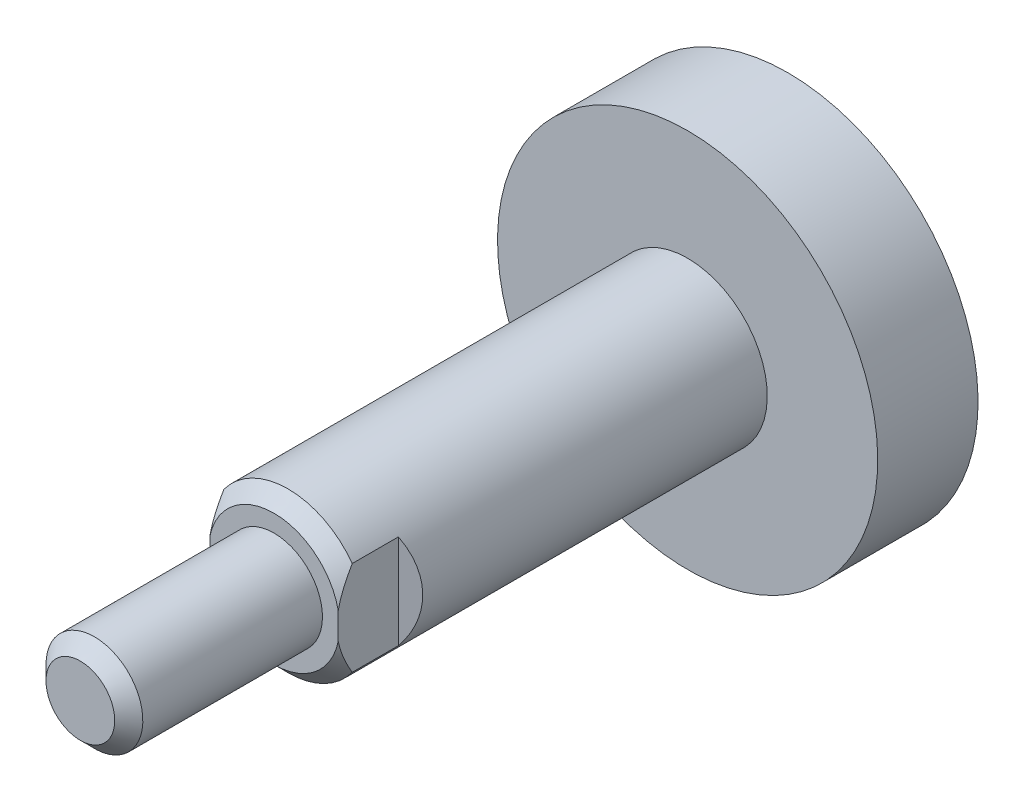
ISO-10303-21;
HEADER;
FILE_DESCRIPTION(('STEP AP214'),'2;1');
FILE_NAME('part.step','',(''),(''),'','','');
FILE_SCHEMA(('AUTOMOTIVE_DESIGN { 1 0 10303 214 1 1 1 1 }'));
ENDSEC;
DATA;
#1=APPLICATION_CONTEXT('core data for automotive mechanical design processes');
#2=APPLICATION_PROTOCOL_DEFINITION('international standard','automotive_design',2000,#1);
#3=PRODUCT_CONTEXT('',#1,'mechanical');
#4=PRODUCT('Part','Part','',(#3));
#5=PRODUCT_RELATED_PRODUCT_CATEGORY('part','',(#4));
#6=PRODUCT_DEFINITION_FORMATION('','',#4);
#7=PRODUCT_DEFINITION_CONTEXT('part definition',#1,'design');
#8=PRODUCT_DEFINITION('design','',#6,#7);
#9=PRODUCT_DEFINITION_SHAPE('','',#8);
#10=(LENGTH_UNIT() NAMED_UNIT(*) SI_UNIT(.MILLI.,.METRE.));
#11=(NAMED_UNIT(*) PLANE_ANGLE_UNIT() SI_UNIT($,.RADIAN.));
#12=(NAMED_UNIT(*) SI_UNIT($,.STERADIAN.) SOLID_ANGLE_UNIT());
#13=UNCERTAINTY_MEASURE_WITH_UNIT(LENGTH_MEASURE(1.E-05),#10,'distance_accuracy_value','');
#14=(GEOMETRIC_REPRESENTATION_CONTEXT(3) GLOBAL_UNCERTAINTY_ASSIGNED_CONTEXT((#13)) GLOBAL_UNIT_ASSIGNED_CONTEXT((#10,
#11,#12)) REPRESENTATION_CONTEXT('',''));
#15=CARTESIAN_POINT('',(0.,0.,0.));
#16=DIRECTION('',(0.,0.,1.));
#17=DIRECTION('',(1.,0.,0.));
#18=AXIS2_PLACEMENT_3D('',#15,#16,#17);
#19=CARTESIAN_POINT('',(0.,0.,35.266));
#20=DIRECTION('',(0.,0.,1.));
#21=DIRECTION('',(0.,-1.,0.));
#22=AXIS2_PLACEMENT_3D('',#19,#20,#21);
#23=PLANE('',#22);
#24=CARTESIAN_POINT('',(0.,0.,35.2659999999219));
#25=DIRECTION('',(0.,0.,-1.));
#26=DIRECTION('',(-1.,0.,0.));
#27=AXIS2_PLACEMENT_3D('',#24,#25,#26);
#28=CIRCLE('',#27,1.71299999999519);
#29=CARTESIAN_POINT('',(-1.71299999999519,0.,35.2659999999219));
#30=VERTEX_POINT('',#29);
#31=EDGE_CURVE('E19',#30,#30,#28,.T.);
#32=ORIENTED_EDGE('',*,*,#31,.F.);
#33=EDGE_LOOP('',(#32));
#34=FACE_BOUND('',#33,.T.);
#35=ADVANCED_FACE('F16',(#34),#23,.T.);
#36=CARTESIAN_POINT('',(0.,0.,34.5659999999839));
#37=DIRECTION('',(0.,0.,-1.));
#38=DIRECTION('',(-1.,0.,0.));
#39=AXIS2_PLACEMENT_3D('',#36,#37,#38);
#40=CONICAL_SURFACE('',#39,2.41299999993316,0.785398163397448);
#41=ORIENTED_EDGE('',*,*,#31,.T.);
#42=EDGE_LOOP('',(#41));
#43=FACE_BOUND('',#42,.T.);
#44=CARTESIAN_POINT('',(0.,0.,34.566));
#45=DIRECTION('',(0.,0.,-1.));
#46=DIRECTION('',(0.,1.,0.));
#47=AXIS2_PLACEMENT_3D('',#44,#45,#46);
#48=CIRCLE('',#47,2.413);
#49=CARTESIAN_POINT('',(0.,2.413,34.566));
#50=VERTEX_POINT('',#49);
#51=EDGE_CURVE('E71',#50,#50,#48,.T.);
#52=ORIENTED_EDGE('',*,*,#51,.F.);
#53=EDGE_LOOP('',(#52));
#54=FACE_BOUND('',#53,.T.);
#55=ADVANCED_FACE('F196',(#43,#54),#40,.T.);
#56=CARTESIAN_POINT('',(0.,0.,35.266));
#57=DIRECTION('',(0.,0.,-1.));
#58=DIRECTION('',(0.,1.,0.));
#59=AXIS2_PLACEMENT_3D('',#56,#57,#58);
#60=CYLINDRICAL_SURFACE('',#59,2.413);
#61=ORIENTED_EDGE('',*,*,#51,.T.);
#62=EDGE_LOOP('',(#61));
#63=FACE_BOUND('',#62,.T.);
#64=CARTESIAN_POINT('',(0.,0.,25.614));
#65=DIRECTION('',(0.,0.,-1.));
#66=DIRECTION('',(0.,1.,0.));
#67=AXIS2_PLACEMENT_3D('',#64,#65,#66);
#68=CIRCLE('',#67,2.413);
#69=CARTESIAN_POINT('',(0.,2.413,25.614));
#70=VERTEX_POINT('',#69);
#71=EDGE_CURVE('E70',#70,#70,#68,.F.);
#72=ORIENTED_EDGE('',*,*,#71,.T.);
#73=EDGE_LOOP('',(#72));
#74=FACE_BOUND('',#73,.T.);
#75=ADVANCED_FACE('F204',(#63,#74),#60,.T.);
#76=CARTESIAN_POINT('',(0.,0.,25.614));
#77=DIRECTION('',(0.,0.,-1.));
#78=DIRECTION('',(0.,1.,0.));
#79=AXIS2_PLACEMENT_3D('',#76,#77,#78);
#80=PLANE('',#79);
#81=ORIENTED_EDGE('',*,*,#71,.F.);
#82=EDGE_LOOP('',(#81));
#83=FACE_BOUND('',#82,.T.);
#84=DIRECTION('',(0.,1.,0.));
#85=VECTOR('',#84,1.);
#86=CARTESIAN_POINT('',(3.2,0.,25.614));
#87=LINE('',#86,#85);
#88=CARTESIAN_POINT('',(3.2,0.66810253703174,25.6140000000093));
#89=VERTEX_POINT('',#88);
#90=CARTESIAN_POINT('',(3.2,-0.668102537031729,25.6140000000093));
#91=VERTEX_POINT('',#90);
#92=EDGE_CURVE('E58',#89,#91,#87,.F.);
#93=ORIENTED_EDGE('',*,*,#92,.F.);
#94=CARTESIAN_POINT('',(0.,0.,25.6140000000187));
#95=DIRECTION('',(0.,0.,-1.));
#96=DIRECTION('',(0.,1.,0.));
#97=AXIS2_PLACEMENT_3D('',#94,#95,#96);
#98=CIRCLE('',#97,3.26899999998887);
#99=CARTESIAN_POINT('',(-3.2,0.668102537031733,25.6140000000093));
#100=VERTEX_POINT('',#99);
#101=EDGE_CURVE('E91',#100,#89,#98,.T.);
#102=ORIENTED_EDGE('',*,*,#101,.F.);
#103=DIRECTION('',(0.,1.,0.));
#104=VECTOR('',#103,1.);
#105=CARTESIAN_POINT('',(-3.2,-9.475,25.614));
#106=LINE('',#105,#104);
#107=CARTESIAN_POINT('',(-3.2,-0.668102537013458,25.6140000000131));
#108=VERTEX_POINT('',#107);
#109=EDGE_CURVE('E77',#100,#108,#106,.F.);
#110=ORIENTED_EDGE('',*,*,#109,.T.);
#111=CARTESIAN_POINT('',(0.,0.,25.6140000000187));
#112=DIRECTION('',(0.,0.,-1.));
#113=DIRECTION('',(0.,1.,0.));
#114=AXIS2_PLACEMENT_3D('',#111,#112,#113);
#115=CIRCLE('',#114,3.26899999998887);
#116=EDGE_CURVE('E75',#91,#108,#115,.T.);
#117=ORIENTED_EDGE('',*,*,#116,.F.);
#118=EDGE_LOOP('',(#93,#102,#110,#117));
#119=FACE_BOUND('',#118,.T.);
#120=ADVANCED_FACE('F76',(#83,#119),#80,.F.);
#121=CARTESIAN_POINT('',(0.,0.,24.9140000000807));
#122=DIRECTION('',(0.,0.,-1.));
#123=DIRECTION('',(0.,1.,0.));
#124=AXIS2_PLACEMENT_3D('',#121,#122,#123);
#125=CONICAL_SURFACE('',#124,3.96899999992684,0.785398163397448);
#126=CARTESIAN_POINT('',(-3.2,-0.668102537040877,25.6140000000075));
#127=CARTESIAN_POINT('',(-3.2,-0.791923989295427,25.5887118948215));
#128=CARTESIAN_POINT('',(-3.2,-0.91421443217869,25.5569533814341));
#129=CARTESIAN_POINT('',(-3.2,-1.15522323064115,25.4827867348097));
#130=CARTESIAN_POINT('',(-3.2,-1.27394966581364,25.4404051094269));
#131=CARTESIAN_POINT('',(-3.2,-1.50692397326224,25.3475394481761));
#132=CARTESIAN_POINT('',(-3.2,-1.62120166832552,25.2971285477306));
#133=CARTESIAN_POINT('',(-3.2,-1.84665634636372,25.1897204575844));
#134=CARTESIAN_POINT('',(-3.2,-1.95783200279579,25.1327205021723));
#135=CARTESIAN_POINT('',(-3.2,-2.11477722577384,25.0475447828539));
#136=CARTESIAN_POINT('',(-3.2,-2.1617013623651,25.0214620111321));
#137=CARTESIAN_POINT('',(-3.2,-2.25515024750113,24.9683835316657));
#138=CARTESIAN_POINT('',(-3.2,-2.30167405354123,24.9413861634533));
#139=CARTESIAN_POINT('',(-3.2,-2.34796954835779,24.9140000000056));
#140=B_SPLINE_CURVE_WITH_KNOTS('',3,(#126,#127,#128,#129,#130,#131,#132,#133,#134,#135,#136,
#137,#138,#139),.UNSPECIFIED.,.F.,.F.,(4,2,2,2,2,2,4),(0.,0.378663318902455,0.756391005201612,
1.13085654272106,1.50547983428745,1.66653163358814,1.82789340191387),.UNSPECIFIED.);
#141=CARTESIAN_POINT('',(-3.2,-2.34796954835613,24.9140000000028));
#142=VERTEX_POINT('',#141);
#143=EDGE_CURVE('E116',#108,#142,#140,.T.);
#144=ORIENTED_EDGE('',*,*,#143,.T.);
#145=CARTESIAN_POINT('',(0.,0.,24.914));
#146=DIRECTION('',(0.,0.,-1.));
#147=DIRECTION('',(0.,1.,0.));
#148=AXIS2_PLACEMENT_3D('',#145,#146,#147);
#149=CIRCLE('',#148,3.969);
#150=CARTESIAN_POINT('',(3.2,-2.34796954835614,24.9140000000028));
#151=VERTEX_POINT('',#150);
#152=EDGE_CURVE('E85',#151,#142,#149,.T.);
#153=ORIENTED_EDGE('',*,*,#152,.F.);
#154=CARTESIAN_POINT('',(3.2,-2.34796954835779,24.9140000000056));
#155=CARTESIAN_POINT('',(3.2,-2.28227540636543,24.9528576848515));
#156=CARTESIAN_POINT('',(3.2,-2.21612013327483,24.9909397042059));
#157=CARTESIAN_POINT('',(3.2,-2.08277615456897,25.0652931600532));
#158=CARTESIAN_POINT('',(3.2,-2.01558715528861,25.1015640691339));
#159=CARTESIAN_POINT('',(3.2,-1.81330543749888,25.2067462963329));
#160=CARTESIAN_POINT('',(3.2,-1.67658349378556,25.2725768397095));
#161=CARTESIAN_POINT('',(3.2,-1.39788707533627,25.3932563066724));
#162=CARTESIAN_POINT('',(3.2,-1.25590184063825,25.4480810761766));
#163=CARTESIAN_POINT('',(3.2,-0.966123687789918,25.543157171903));
#164=CARTESIAN_POINT('',(3.2,-0.818297789803371,25.5833066541195));
#165=CARTESIAN_POINT('',(3.2,-0.668102537040844,25.6140000000075));
#166=B_SPLINE_CURVE_WITH_KNOTS('',3,(#154,#155,#156,#157,#158,#159,#160,#161,#162,#163,#164,
#165),.UNSPECIFIED.,.F.,.F.,(4,2,2,2,2,4),(0.,0.228972156487763,0.458010607517,
0.912891486437008,1.36876002116515,1.82773469580356),.UNSPECIFIED.);
#167=EDGE_CURVE('E63',#151,#91,#166,.T.);
#168=ORIENTED_EDGE('',*,*,#167,.T.);
#169=ORIENTED_EDGE('',*,*,#116,.T.);
#170=EDGE_LOOP('',(#144,#153,#168,#169));
#171=FACE_BOUND('',#170,.T.);
#172=ADVANCED_FACE('F84',(#171),#125,.T.);
#173=CARTESIAN_POINT('',(3.2,-9.475,22.614));
#174=DIRECTION('',(-0.500000000000005,0.,-0.866025403784436));
#175=DIRECTION('',(-0.866025403784436,0.,0.500000000000005));
#176=AXIS2_PLACEMENT_3D('',#173,#174,#175);
#177=PLANE('',#176);
#178=CARTESIAN_POINT('',(0.,0.,24.4615208614068));
#179=DIRECTION('',(-0.500000000000005,0.,-0.866025403784436));
#180=DIRECTION('',(0.866025403784436,0.,-0.500000000000005));
#181=AXIS2_PLACEMENT_3D('',#178,#179,#180);
#182=ELLIPSE('',#181,4.58300643682726,3.969);
#183=CARTESIAN_POINT('',(3.2,2.3479695483545,22.614));
#184=VERTEX_POINT('',#183);
#185=CARTESIAN_POINT('',(3.2,-2.34796954835449,22.614));
#186=VERTEX_POINT('',#185);
#187=EDGE_CURVE('E175',#184,#186,#182,.T.);
#188=ORIENTED_EDGE('',*,*,#187,.F.);
#189=DIRECTION('',(0.,-1.,0.));
#190=VECTOR('',#189,1.);
#191=CARTESIAN_POINT('',(3.2,-9.475,22.614));
#192=LINE('',#191,#190);
#193=EDGE_CURVE('E86',#184,#186,#192,.T.);
#194=ORIENTED_EDGE('',*,*,#193,.T.);
#195=EDGE_LOOP('',(#188,#194));
#196=FACE_BOUND('',#195,.T.);
#197=ADVANCED_FACE('F111',(#196),#177,.F.);
#198=CARTESIAN_POINT('',(-3.2,-9.475,22.614));
#199=DIRECTION('',(0.500000000000003,0.,-0.866025403784437));
#200=DIRECTION('',(-0.866025403784437,0.,-0.500000000000003));
#201=AXIS2_PLACEMENT_3D('',#198,#199,#200);
#202=PLANE('',#201);
#203=CARTESIAN_POINT('',(0.,0.,24.4615208614068));
#204=DIRECTION('',(0.500000000000003,0.,-0.866025403784437));
#205=DIRECTION('',(-0.866025403784437,0.,-0.500000000000003));
#206=AXIS2_PLACEMENT_3D('',#203,#204,#205);
#207=ELLIPSE('',#206,4.58300643682726,3.969);
#208=CARTESIAN_POINT('',(-3.2,-2.34796954835448,22.614));
#209=VERTEX_POINT('',#208);
#210=CARTESIAN_POINT('',(-3.2,2.34796954835449,22.614));
#211=VERTEX_POINT('',#210);
#212=EDGE_CURVE('E172',#209,#211,#207,.T.);
#213=ORIENTED_EDGE('',*,*,#212,.F.);
#214=DIRECTION('',(0.,1.,0.));
#215=VECTOR('',#214,1.);
#216=CARTESIAN_POINT('',(-3.2,-9.475,22.614));
#217=LINE('',#216,#215);
#218=EDGE_CURVE('E81',#209,#211,#217,.T.);
#219=ORIENTED_EDGE('',*,*,#218,.T.);
#220=EDGE_LOOP('',(#213,#219));
#221=FACE_BOUND('',#220,.T.);
#222=ADVANCED_FACE('F129',(#221),#202,.F.);
#223=CARTESIAN_POINT('',(-3.2,-9.475,25.614));
#224=DIRECTION('',(1.,0.,0.));
#225=DIRECTION('',(0.,1.,0.));
#226=AXIS2_PLACEMENT_3D('',#223,#224,#225);
#227=PLANE('',#226);
#228=ORIENTED_EDGE('',*,*,#143,.F.);
#229=ORIENTED_EDGE('',*,*,#109,.F.);
#230=CARTESIAN_POINT('',(-3.2,2.34796954835963,24.9140000000045));
#231=CARTESIAN_POINT('',(-3.2,2.28227540636708,24.9528576848505));
#232=CARTESIAN_POINT('',(-3.2,2.21612013327628,24.9909397042051));
#233=CARTESIAN_POINT('',(-3.2,2.08277615457002,25.0652931600527));
#234=CARTESIAN_POINT('',(-3.2,2.01558715528946,25.1015640691335));
#235=CARTESIAN_POINT('',(-3.2,1.81330543749914,25.2067462963328));
#236=CARTESIAN_POINT('',(-3.2,1.67658349378541,25.2725768397096));
#237=CARTESIAN_POINT('',(-3.2,1.39788707533526,25.3932563066728));
#238=CARTESIAN_POINT('',(-3.2,1.25590184063679,25.4480810761771));
#239=CARTESIAN_POINT('',(-3.2,0.966123687787533,25.5431571719037));
#240=CARTESIAN_POINT('',(-3.2,0.818297789800503,25.5833066541203));
#241=CARTESIAN_POINT('',(-3.2,0.668102537037482,25.6140000000082));
#242=B_SPLINE_CURVE_WITH_KNOTS('',3,(#230,#231,#232,#233,#234,#235,#236,#237,#238,#239,#240,
#241),.UNSPECIFIED.,.F.,.F.,(4,2,2,2,2,4),(0.,0.228972156488461,0.458010607518398,
0.912891486439775,1.3687600211693,1.82773469580912),.UNSPECIFIED.);
#243=CARTESIAN_POINT('',(-3.2,2.3479695483545,24.9140000000038));
#244=VERTEX_POINT('',#243);
#245=EDGE_CURVE('E121',#244,#100,#242,.T.);
#246=ORIENTED_EDGE('',*,*,#245,.F.);
#247=DIRECTION('',(0.,0.,-1.));
#248=VECTOR('',#247,1.);
#249=CARTESIAN_POINT('',(-3.2,2.3479695483545,36.8400272581176));
#250=LINE('',#249,#248);
#251=EDGE_CURVE('E174',#211,#244,#250,.F.);
#252=ORIENTED_EDGE('',*,*,#251,.F.);
#253=ORIENTED_EDGE('',*,*,#218,.F.);
#254=DIRECTION('',(0.,0.,-1.));
#255=VECTOR('',#254,1.);
#256=CARTESIAN_POINT('',(-3.2,-2.34796954835448,36.8400272581176));
#257=LINE('',#256,#255);
#258=EDGE_CURVE('E177',#142,#209,#257,.T.);
#259=ORIENTED_EDGE('',*,*,#258,.F.);
#260=EDGE_LOOP('',(#228,#229,#246,#252,#253,#259));
#261=FACE_BOUND('',#260,.T.);
#262=ADVANCED_FACE('F125',(#261),#227,.F.);
#263=CARTESIAN_POINT('',(0.,0.,24.9140000000807));
#264=DIRECTION('',(0.,0.,-1.));
#265=DIRECTION('',(0.,1.,0.));
#266=AXIS2_PLACEMENT_3D('',#263,#264,#265);
#267=CONICAL_SURFACE('',#266,3.96899999992684,0.785398163397448);
#268=ORIENTED_EDGE('',*,*,#245,.T.);
#269=ORIENTED_EDGE('',*,*,#101,.T.);
#270=CARTESIAN_POINT('',(3.2,0.668102537040898,25.6140000000075));
#271=CARTESIAN_POINT('',(3.2,0.791923989295448,25.5887118948215));
#272=CARTESIAN_POINT('',(3.2,0.914214432178712,25.5569533814341));
#273=CARTESIAN_POINT('',(3.2,1.15522323064117,25.4827867348097));
#274=CARTESIAN_POINT('',(3.2,1.27394966581367,25.4404051094269));
#275=CARTESIAN_POINT('',(3.2,1.50692397326226,25.3475394481761));
#276=CARTESIAN_POINT('',(3.2,1.62120166832555,25.2971285477306));
#277=CARTESIAN_POINT('',(3.2,1.84665634636375,25.1897204575844));
#278=CARTESIAN_POINT('',(3.2,1.95783200279581,25.1327205021723));
#279=CARTESIAN_POINT('',(3.2,2.11477722577386,25.0475447828539));
#280=CARTESIAN_POINT('',(3.2,2.16170136236512,25.0214620111321));
#281=CARTESIAN_POINT('',(3.2,2.25515024750115,24.9683835316657));
#282=CARTESIAN_POINT('',(3.2,2.30167405354124,24.9413861634533));
#283=CARTESIAN_POINT('',(3.2,2.34796954835781,24.9140000000056));
#284=B_SPLINE_CURVE_WITH_KNOTS('',3,(#270,#271,#272,#273,#274,#275,#276,#277,#278,#279,#280,
#281,#282,#283),.UNSPECIFIED.,.F.,.F.,(4,2,2,2,2,2,4),(0.,0.378663318902457,0.756391005201615,
1.13085654272107,1.50547983428746,1.66653163358814,1.82789340191387),.UNSPECIFIED.);
#285=CARTESIAN_POINT('',(3.2,2.34796954835615,24.9140000000028));
#286=VERTEX_POINT('',#285);
#287=EDGE_CURVE('E66',#89,#286,#284,.T.);
#288=ORIENTED_EDGE('',*,*,#287,.T.);
#289=CARTESIAN_POINT('',(0.,0.,24.914));
#290=DIRECTION('',(0.,0.,-1.));
#291=DIRECTION('',(0.,1.,0.));
#292=AXIS2_PLACEMENT_3D('',#289,#290,#291);
#293=CIRCLE('',#292,3.969);
#294=EDGE_CURVE('E34',#244,#286,#293,.T.);
#295=ORIENTED_EDGE('',*,*,#294,.F.);
#296=EDGE_LOOP('',(#268,#269,#288,#295));
#297=FACE_BOUND('',#296,.T.);
#298=ADVANCED_FACE('F128',(#297),#267,.T.);
#299=CARTESIAN_POINT('',(3.2,-9.475,25.614));
#300=DIRECTION('',(-1.,0.,0.));
#301=DIRECTION('',(0.,-1.,0.));
#302=AXIS2_PLACEMENT_3D('',#299,#300,#301);
#303=PLANE('',#302);
#304=ORIENTED_EDGE('',*,*,#287,.F.);
#305=ORIENTED_EDGE('',*,*,#92,.T.);
#306=ORIENTED_EDGE('',*,*,#167,.F.);
#307=DIRECTION('',(0.,0.,-1.));
#308=VECTOR('',#307,1.);
#309=CARTESIAN_POINT('',(3.2,-2.34796954835449,36.8400272581176));
#310=LINE('',#309,#308);
#311=EDGE_CURVE('E88',#186,#151,#310,.F.);
#312=ORIENTED_EDGE('',*,*,#311,.F.);
#313=ORIENTED_EDGE('',*,*,#193,.F.);
#314=DIRECTION('',(0.,0.,-1.));
#315=VECTOR('',#314,1.);
#316=CARTESIAN_POINT('',(3.2,2.3479695483545,36.8400272581176));
#317=LINE('',#316,#315);
#318=EDGE_CURVE('E166',#286,#184,#317,.T.);
#319=ORIENTED_EDGE('',*,*,#318,.F.);
#320=EDGE_LOOP('',(#304,#305,#306,#312,#313,#319));
#321=FACE_BOUND('',#320,.T.);
#322=ADVANCED_FACE('F60',(#321),#303,.F.);
#323=CARTESIAN_POINT('',(0.,0.,36.8400272581176));
#324=DIRECTION('',(0.,0.,-1.));
#325=DIRECTION('',(0.,1.,0.));
#326=AXIS2_PLACEMENT_3D('',#323,#324,#325);
#327=CYLINDRICAL_SURFACE('',#326,3.969);
#328=CARTESIAN_POINT('',(0.,0.,5.));
#329=DIRECTION('',(0.,0.,-1.));
#330=DIRECTION('',(0.,1.,0.));
#331=AXIS2_PLACEMENT_3D('',#328,#329,#330);
#332=CIRCLE('',#331,3.969);
#333=CARTESIAN_POINT('',(0.,3.96900000000001,5.));
#334=VERTEX_POINT('',#333);
#335=EDGE_CURVE('E164',#334,#334,#332,.T.);
#336=ORIENTED_EDGE('',*,*,#335,.F.);
#337=EDGE_LOOP('',(#336));
#338=FACE_BOUND('',#337,.T.);
#339=ORIENTED_EDGE('',*,*,#294,.T.);
#340=ORIENTED_EDGE('',*,*,#318,.T.);
#341=ORIENTED_EDGE('',*,*,#187,.T.);
#342=ORIENTED_EDGE('',*,*,#311,.T.);
#343=ORIENTED_EDGE('',*,*,#152,.T.);
#344=ORIENTED_EDGE('',*,*,#258,.T.);
#345=ORIENTED_EDGE('',*,*,#212,.T.);
#346=ORIENTED_EDGE('',*,*,#251,.T.);
#347=EDGE_LOOP('',(#339,#340,#341,#342,#343,#344,#345,#346));
#348=FACE_BOUND('',#347,.T.);
#349=ADVANCED_FACE('F155',(#338,#348),#327,.T.);
#350=CARTESIAN_POINT('',(0.,0.,5.));
#351=DIRECTION('',(0.,0.,1.));
#352=DIRECTION('',(0.,-1.,0.));
#353=AXIS2_PLACEMENT_3D('',#350,#351,#352);
#354=PLANE('',#353);
#355=CARTESIAN_POINT('',(0.,0.,5.));
#356=DIRECTION('',(0.,0.,-1.));
#357=DIRECTION('',(0.,1.,0.));
#358=AXIS2_PLACEMENT_3D('',#355,#356,#357);
#359=CIRCLE('',#358,9.475);
#360=CARTESIAN_POINT('',(0.,9.475,5.));
#361=VERTEX_POINT('',#360);
#362=EDGE_CURVE('E25',#361,#361,#359,.T.);
#363=ORIENTED_EDGE('',*,*,#362,.F.);
#364=EDGE_LOOP('',(#363));
#365=FACE_BOUND('',#364,.T.);
#366=ORIENTED_EDGE('',*,*,#335,.T.);
#367=EDGE_LOOP('',(#366));
#368=FACE_BOUND('',#367,.T.);
#369=ADVANCED_FACE('F149',(#365,#368),#354,.T.);
#370=CARTESIAN_POINT('',(0.,0.,5.));
#371=DIRECTION('',(0.,0.,-1.));
#372=DIRECTION('',(0.,1.,0.));
#373=AXIS2_PLACEMENT_3D('',#370,#371,#372);
#374=CYLINDRICAL_SURFACE('',#373,9.475);
#375=ORIENTED_EDGE('',*,*,#362,.T.);
#376=EDGE_LOOP('',(#375));
#377=FACE_BOUND('',#376,.T.);
#378=CARTESIAN_POINT('',(0.,0.,0.));
#379=DIRECTION('',(0.,0.,-1.));
#380=DIRECTION('',(0.,1.,0.));
#381=AXIS2_PLACEMENT_3D('',#378,#379,#380);
#382=CIRCLE('',#381,9.475);
#383=CARTESIAN_POINT('',(0.,9.475,0.));
#384=VERTEX_POINT('',#383);
#385=EDGE_CURVE('E11',#384,#384,#382,.F.);
#386=ORIENTED_EDGE('',*,*,#385,.T.);
#387=EDGE_LOOP('',(#386));
#388=FACE_BOUND('',#387,.T.);
#389=ADVANCED_FACE('F143',(#377,#388),#374,.T.);
#390=CARTESIAN_POINT('',(0.,0.,0.));
#391=DIRECTION('',(0.,0.,1.));
#392=DIRECTION('',(0.,-1.,0.));
#393=AXIS2_PLACEMENT_3D('',#390,#391,#392);
#394=PLANE('',#393);
#395=ORIENTED_EDGE('',*,*,#385,.F.);
#396=EDGE_LOOP('',(#395));
#397=FACE_BOUND('',#396,.T.);
#398=ADVANCED_FACE('F141',(#397),#394,.F.);
#399=CLOSED_SHELL('',(#35,#55,#75,#120,#172,#197,#222,#262,#298,#322,#349,#369,#389,#398));
#400=MANIFOLD_SOLID_BREP('B1',#399);
#401=ADVANCED_BREP_SHAPE_REPRESENTATION('',(#18,#400),#14);
#402=SHAPE_DEFINITION_REPRESENTATION(#9,#401);
ENDSEC;
END-ISO-10303-21;
